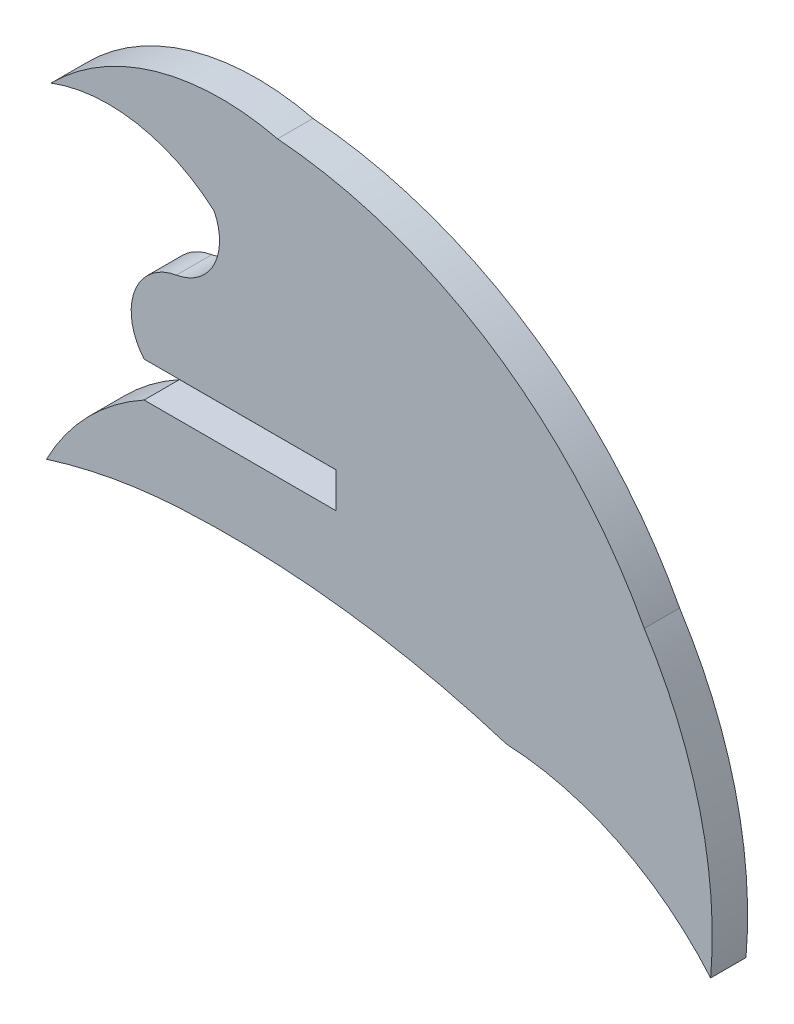
ISO-10303-21;
HEADER;
FILE_DESCRIPTION(('STEP AP214'),'2;1');
FILE_NAME('part.step','',(''),(''),'','','');
FILE_SCHEMA(('AUTOMOTIVE_DESIGN { 1 0 10303 214 1 1 1 1 }'));
ENDSEC;
DATA;
#1=APPLICATION_CONTEXT('core data for automotive mechanical design processes');
#2=APPLICATION_PROTOCOL_DEFINITION('international standard','automotive_design',2000,#1);
#3=PRODUCT_CONTEXT('',#1,'mechanical');
#4=PRODUCT('Part','Part','',(#3));
#5=PRODUCT_RELATED_PRODUCT_CATEGORY('part','',(#4));
#6=PRODUCT_DEFINITION_FORMATION('','',#4);
#7=PRODUCT_DEFINITION_CONTEXT('part definition',#1,'design');
#8=PRODUCT_DEFINITION('design','',#6,#7);
#9=PRODUCT_DEFINITION_SHAPE('','',#8);
#10=(LENGTH_UNIT() NAMED_UNIT(*) SI_UNIT(.MILLI.,.METRE.));
#11=(NAMED_UNIT(*) PLANE_ANGLE_UNIT() SI_UNIT($,.RADIAN.));
#12=(NAMED_UNIT(*) SI_UNIT($,.STERADIAN.) SOLID_ANGLE_UNIT());
#13=UNCERTAINTY_MEASURE_WITH_UNIT(LENGTH_MEASURE(1.E-05),#10,'distance_accuracy_value','');
#14=(GEOMETRIC_REPRESENTATION_CONTEXT(3) GLOBAL_UNCERTAINTY_ASSIGNED_CONTEXT((#13)) GLOBAL_UNIT_ASSIGNED_CONTEXT((#10,
#11,#12)) REPRESENTATION_CONTEXT('',''));
#15=CARTESIAN_POINT('',(0.,0.,0.));
#16=DIRECTION('',(0.,0.,1.));
#17=DIRECTION('',(1.,0.,0.));
#18=AXIS2_PLACEMENT_3D('',#15,#16,#17);
#19=CARTESIAN_POINT('',(4.09875416760535,-21.0416221765068,1.524));
#20=DIRECTION('',(0.,0.,-1.));
#21=DIRECTION('',(-1.,0.,0.));
#22=AXIS2_PLACEMENT_3D('',#19,#20,#21);
#23=CYLINDRICAL_SURFACE('',#22,12.343629066814);
#24=CARTESIAN_POINT('',(4.09875416760535,-21.0416221765068,0.));
#25=DIRECTION('',(0.,0.,-1.));
#26=DIRECTION('',(1.,0.,0.));
#27=AXIS2_PLACEMENT_3D('',#24,#25,#26);
#28=CIRCLE('',#27,12.343629066814);
#29=CARTESIAN_POINT('',(4.69712194571442,-8.71250483011021,0.));
#30=VERTEX_POINT('',#29);
#31=CARTESIAN_POINT('',(13.5003168965857,-13.0431350200413,0.));
#32=VERTEX_POINT('',#31);
#33=EDGE_CURVE('E160',#30,#32,#28,.T.);
#34=ORIENTED_EDGE('',*,*,#33,.T.);
#35=DIRECTION('',(0.,0.,-1.));
#36=VECTOR('',#35,1.);
#37=CARTESIAN_POINT('',(13.5003168965857,-13.0431350200413,1.524));
#38=LINE('',#37,#36);
#39=CARTESIAN_POINT('',(13.5003168965857,-13.0431350200413,1.524));
#40=VERTEX_POINT('',#39);
#41=EDGE_CURVE('E11',#40,#32,#38,.T.);
#42=ORIENTED_EDGE('',*,*,#41,.F.);
#43=CARTESIAN_POINT('',(4.09875416760535,-21.0416221765068,1.524));
#44=DIRECTION('',(0.,0.,-1.));
#45=DIRECTION('',(1.,0.,0.));
#46=AXIS2_PLACEMENT_3D('',#43,#44,#45);
#47=CIRCLE('',#46,12.343629066814);
#48=CARTESIAN_POINT('',(4.69712194571442,-8.71250483011021,1.524));
#49=VERTEX_POINT('',#48);
#50=EDGE_CURVE('E184',#49,#40,#47,.T.);
#51=ORIENTED_EDGE('',*,*,#50,.F.);
#52=DIRECTION('',(0.,0.,-1.));
#53=VECTOR('',#52,1.);
#54=CARTESIAN_POINT('',(4.69712194571442,-8.71250483011021,1.524));
#55=LINE('',#54,#53);
#56=EDGE_CURVE('E156',#49,#30,#55,.T.);
#57=ORIENTED_EDGE('',*,*,#56,.T.);
#58=EDGE_LOOP('',(#34,#42,#51,#57));
#59=FACE_BOUND('',#58,.T.);
#60=ADVANCED_FACE('F34',(#59),#23,.F.);
#61=CARTESIAN_POINT('',(-4.96687949507016,-11.4361547768725,1.524));
#62=DIRECTION('',(0.,0.,-1.));
#63=DIRECTION('',(-1.,0.,0.));
#64=AXIS2_PLACEMENT_3D('',#61,#62,#63);
#65=CYLINDRICAL_SURFACE('',#64,18.5369827121331);
#66=CARTESIAN_POINT('',(-4.96687949507016,-11.4361547768725,0.));
#67=DIRECTION('',(0.,0.,1.));
#68=DIRECTION('',(-1.,0.,0.));
#69=AXIS2_PLACEMENT_3D('',#66,#67,#68);
#70=CIRCLE('',#69,18.5369827121331);
#71=CARTESIAN_POINT('',(10.6404097611869,-1.4345423997881,0.));
#72=VERTEX_POINT('',#71);
#73=EDGE_CURVE('E163',#32,#72,#70,.T.);
#74=ORIENTED_EDGE('',*,*,#73,.T.);
#75=DIRECTION('',(0.,0.,-1.));
#76=VECTOR('',#75,1.);
#77=CARTESIAN_POINT('',(10.6404097611869,-1.4345423997881,1.524));
#78=LINE('',#77,#76);
#79=CARTESIAN_POINT('',(10.6404097611869,-1.4345423997881,1.524));
#80=VERTEX_POINT('',#79);
#81=EDGE_CURVE('E42',#80,#72,#78,.T.);
#82=ORIENTED_EDGE('',*,*,#81,.F.);
#83=CARTESIAN_POINT('',(-4.96687949507016,-11.4361547768725,1.524));
#84=DIRECTION('',(0.,0.,1.));
#85=DIRECTION('',(-1.,0.,0.));
#86=AXIS2_PLACEMENT_3D('',#83,#84,#85);
#87=CIRCLE('',#86,18.5369827121331);
#88=EDGE_CURVE('E108',#40,#80,#87,.T.);
#89=ORIENTED_EDGE('',*,*,#88,.F.);
#90=ORIENTED_EDGE('',*,*,#41,.T.);
#91=EDGE_LOOP('',(#74,#82,#89,#90));
#92=FACE_BOUND('',#91,.T.);
#93=ADVANCED_FACE('F267',(#92),#65,.T.);
#94=CARTESIAN_POINT('',(-6.6798821897993,-10.6072469546407,1.524));
#95=DIRECTION('',(0.,0.,-1.));
#96=DIRECTION('',(-1.,0.,0.));
#97=AXIS2_PLACEMENT_3D('',#94,#95,#96);
#98=CYLINDRICAL_SURFACE('',#97,19.5992607543757);
#99=CARTESIAN_POINT('',(-6.6798821897993,-10.6072469546407,0.));
#100=DIRECTION('',(0.,0.,1.));
#101=DIRECTION('',(1.,0.,0.));
#102=AXIS2_PLACEMENT_3D('',#99,#100,#101);
#103=CIRCLE('',#102,19.5992607543757);
#104=CARTESIAN_POINT('',(-5.15253886855126,8.93241129459815,0.));
#105=VERTEX_POINT('',#104);
#106=EDGE_CURVE('E165',#72,#105,#103,.T.);
#107=ORIENTED_EDGE('',*,*,#106,.T.);
#108=DIRECTION('',(0.,0.,-1.));
#109=VECTOR('',#108,1.);
#110=CARTESIAN_POINT('',(-5.15253886855126,8.93241129459815,1.524));
#111=LINE('',#110,#109);
#112=CARTESIAN_POINT('',(-5.15253886855126,8.93241129459815,1.524));
#113=VERTEX_POINT('',#112);
#114=EDGE_CURVE('E206',#113,#105,#111,.T.);
#115=ORIENTED_EDGE('',*,*,#114,.F.);
#116=CARTESIAN_POINT('',(-6.6798821897993,-10.6072469546407,1.524));
#117=DIRECTION('',(0.,0.,1.));
#118=DIRECTION('',(1.,0.,0.));
#119=AXIS2_PLACEMENT_3D('',#116,#117,#118);
#120=CIRCLE('',#119,19.5992607543757);
#121=EDGE_CURVE('E214',#80,#113,#120,.T.);
#122=ORIENTED_EDGE('',*,*,#121,.F.);
#123=ORIENTED_EDGE('',*,*,#81,.T.);
#124=EDGE_LOOP('',(#107,#115,#122,#123));
#125=FACE_BOUND('',#124,.T.);
#126=ADVANCED_FACE('F212',(#125),#98,.T.);
#127=CARTESIAN_POINT('',(-7.56910722269646,-1.04148036988545,1.524));
#128=DIRECTION('',(0.,0.,-1.));
#129=DIRECTION('',(-1.,0.,0.));
#130=AXIS2_PLACEMENT_3D('',#127,#128,#129);
#131=CYLINDRICAL_SURFACE('',#130,10.2624713176267);
#132=CARTESIAN_POINT('',(-7.56910722269646,-1.04148036988545,0.));
#133=DIRECTION('',(0.,0.,1.));
#134=DIRECTION('',(-1.,0.,0.));
#135=AXIS2_PLACEMENT_3D('',#132,#133,#134);
#136=CIRCLE('',#135,10.2624713176267);
#137=CARTESIAN_POINT('',(-14.9073988184123,6.13262542814665,0.));
#138=VERTEX_POINT('',#137);
#139=EDGE_CURVE('E167',#105,#138,#136,.T.);
#140=ORIENTED_EDGE('',*,*,#139,.T.);
#141=DIRECTION('',(0.,0.,-1.));
#142=VECTOR('',#141,1.);
#143=CARTESIAN_POINT('',(-14.9073988184123,6.13262542814665,1.524));
#144=LINE('',#143,#142);
#145=CARTESIAN_POINT('',(-14.9073988184123,6.13262542814665,1.524));
#146=VERTEX_POINT('',#145);
#147=EDGE_CURVE('E203',#146,#138,#144,.T.);
#148=ORIENTED_EDGE('',*,*,#147,.F.);
#149=CARTESIAN_POINT('',(-7.56910722269646,-1.04148036988545,1.524));
#150=DIRECTION('',(0.,0.,1.));
#151=DIRECTION('',(-1.,0.,0.));
#152=AXIS2_PLACEMENT_3D('',#149,#150,#151);
#153=CIRCLE('',#152,10.2624713176267);
#154=EDGE_CURVE('E232',#113,#146,#153,.T.);
#155=ORIENTED_EDGE('',*,*,#154,.F.);
#156=ORIENTED_EDGE('',*,*,#114,.T.);
#157=EDGE_LOOP('',(#140,#148,#155,#156));
#158=FACE_BOUND('',#157,.T.);
#159=ADVANCED_FACE('F223',(#158),#131,.T.);
#160=CARTESIAN_POINT('',(-12.4390952322919,-0.340023654962952,1.524));
#161=DIRECTION('',(0.,0.,-1.));
#162=DIRECTION('',(-1.,0.,0.));
#163=AXIS2_PLACEMENT_3D('',#160,#161,#162);
#164=CYLINDRICAL_SURFACE('',#163,6.92731612865577);
#165=CARTESIAN_POINT('',(-12.4390952322919,-0.340023654962952,0.));
#166=DIRECTION('',(0.,0.,-1.));
#167=DIRECTION('',(1.,0.,0.));
#168=AXIS2_PLACEMENT_3D('',#165,#166,#167);
#169=CIRCLE('',#168,6.92731612865577);
#170=CARTESIAN_POINT('',(-7.88575431551338,4.88058888016404,0.));
#171=VERTEX_POINT('',#170);
#172=EDGE_CURVE('E169',#138,#171,#169,.T.);
#173=ORIENTED_EDGE('',*,*,#172,.T.);
#174=DIRECTION('',(0.,0.,-1.));
#175=VECTOR('',#174,1.);
#176=CARTESIAN_POINT('',(-7.88575431551338,4.88058888016404,1.524));
#177=LINE('',#176,#175);
#178=CARTESIAN_POINT('',(-7.88575431551338,4.88058888016404,1.524));
#179=VERTEX_POINT('',#178);
#180=EDGE_CURVE('E200',#179,#171,#177,.T.);
#181=ORIENTED_EDGE('',*,*,#180,.F.);
#182=CARTESIAN_POINT('',(-12.4390952322919,-0.340023654962952,1.524));
#183=DIRECTION('',(0.,0.,-1.));
#184=DIRECTION('',(1.,0.,0.));
#185=AXIS2_PLACEMENT_3D('',#182,#183,#184);
#186=CIRCLE('',#185,6.92731612865577);
#187=EDGE_CURVE('E229',#146,#179,#186,.T.);
#188=ORIENTED_EDGE('',*,*,#187,.F.);
#189=ORIENTED_EDGE('',*,*,#147,.T.);
#190=EDGE_LOOP('',(#173,#181,#188,#189));
#191=FACE_BOUND('',#190,.T.);
#192=ADVANCED_FACE('F227',(#191),#164,.F.);
#193=CARTESIAN_POINT('',(-9.89407883051692,3.88075028276914,1.524));
#194=DIRECTION('',(0.,0.,-1.));
#195=DIRECTION('',(-1.,0.,0.));
#196=AXIS2_PLACEMENT_3D('',#193,#194,#195);
#197=CYLINDRICAL_SURFACE('',#196,2.24344480172899);
#198=CARTESIAN_POINT('',(-9.89407883051692,3.88075028276914,0.));
#199=DIRECTION('',(0.,0.,-1.));
#200=DIRECTION('',(1.,0.,0.));
#201=AXIS2_PLACEMENT_3D('',#198,#199,#200);
#202=CIRCLE('',#201,2.24344480172899);
#203=CARTESIAN_POINT('',(-9.5117295029412,1.67012739088839,0.));
#204=VERTEX_POINT('',#203);
#205=EDGE_CURVE('E171',#171,#204,#202,.T.);
#206=ORIENTED_EDGE('',*,*,#205,.T.);
#207=DIRECTION('',(0.,0.,-1.));
#208=VECTOR('',#207,1.);
#209=CARTESIAN_POINT('',(-9.5117295029412,1.67012739088839,1.524));
#210=LINE('',#209,#208);
#211=CARTESIAN_POINT('',(-9.5117295029412,1.67012739088839,1.524));
#212=VERTEX_POINT('',#211);
#213=EDGE_CURVE('E197',#212,#204,#210,.T.);
#214=ORIENTED_EDGE('',*,*,#213,.F.);
#215=CARTESIAN_POINT('',(-9.89407883051692,3.88075028276914,1.524));
#216=DIRECTION('',(0.,0.,-1.));
#217=DIRECTION('',(1.,0.,0.));
#218=AXIS2_PLACEMENT_3D('',#215,#216,#217);
#219=CIRCLE('',#218,2.24344480172899);
#220=EDGE_CURVE('E231',#179,#212,#219,.T.);
#221=ORIENTED_EDGE('',*,*,#220,.F.);
#222=ORIENTED_EDGE('',*,*,#180,.T.);
#223=EDGE_LOOP('',(#206,#214,#221,#222));
#224=FACE_BOUND('',#223,.T.);
#225=ADVANCED_FACE('F280',(#224),#197,.F.);
#226=CARTESIAN_POINT('',(-9.11390761549717,-0.640340860817002,1.524));
#227=DIRECTION('',(0.,0.,-1.));
#228=DIRECTION('',(-1.,0.,0.));
#229=AXIS2_PLACEMENT_3D('',#226,#227,#228);
#230=CYLINDRICAL_SURFACE('',#229,2.3444670601798);
#231=CARTESIAN_POINT('',(-9.11390761549717,-0.640340860817002,0.));
#232=DIRECTION('',(0.,0.,1.));
#233=DIRECTION('',(1.,0.,0.));
#234=AXIS2_PLACEMENT_3D('',#231,#232,#233);
#235=CIRCLE('',#234,2.3444670601798);
#236=CARTESIAN_POINT('',(-10.9016832127956,-2.15704261461452,0.));
#237=VERTEX_POINT('',#236);
#238=EDGE_CURVE('E173',#204,#237,#235,.T.);
#239=ORIENTED_EDGE('',*,*,#238,.T.);
#240=DIRECTION('',(0.,0.,-1.));
#241=VECTOR('',#240,1.);
#242=CARTESIAN_POINT('',(-10.9016832127956,-2.15704261461452,1.524));
#243=LINE('',#242,#241);
#244=CARTESIAN_POINT('',(-10.9016832127956,-2.15704261461452,1.524));
#245=VERTEX_POINT('',#244);
#246=EDGE_CURVE('E194',#245,#237,#243,.T.);
#247=ORIENTED_EDGE('',*,*,#246,.F.);
#248=CARTESIAN_POINT('',(-9.11390761549717,-0.640340860817002,1.524));
#249=DIRECTION('',(0.,0.,1.));
#250=DIRECTION('',(1.,0.,0.));
#251=AXIS2_PLACEMENT_3D('',#248,#249,#250);
#252=CIRCLE('',#251,2.3444670601798);
#253=EDGE_CURVE('E234',#212,#245,#252,.T.);
#254=ORIENTED_EDGE('',*,*,#253,.F.);
#255=ORIENTED_EDGE('',*,*,#213,.T.);
#256=EDGE_LOOP('',(#239,#247,#254,#255));
#257=FACE_BOUND('',#256,.T.);
#258=ADVANCED_FACE('F283',(#257),#230,.T.);
#259=CARTESIAN_POINT('',(-2.63595171279561,-2.15505578709308,1.524));
#260=DIRECTION('',(-0.000240369223709465,0.999999971111318,0.));
#261=DIRECTION('',(-0.999999971111318,-0.000240369223709465,0.));
#262=AXIS2_PLACEMENT_3D('',#259,#260,#261);
#263=PLANE('',#262);
#264=DIRECTION('',(0.999999971111318,0.000240369223709465,0.));
#265=VECTOR('',#264,1.);
#266=CARTESIAN_POINT('',(-2.63595171279561,-2.15505578709308,0.));
#267=LINE('',#266,#265);
#268=CARTESIAN_POINT('',(-2.63595171279561,-2.15505578709308,0.));
#269=VERTEX_POINT('',#268);
#270=EDGE_CURVE('E175',#237,#269,#267,.T.);
#271=ORIENTED_EDGE('',*,*,#270,.T.);
#272=DIRECTION('',(0.,0.,-1.));
#273=VECTOR('',#272,1.);
#274=CARTESIAN_POINT('',(-2.63595171279561,-2.15505578709308,1.524));
#275=LINE('',#274,#273);
#276=CARTESIAN_POINT('',(-2.63595171279561,-2.15505578709308,1.524));
#277=VERTEX_POINT('',#276);
#278=EDGE_CURVE('E191',#277,#269,#275,.T.);
#279=ORIENTED_EDGE('',*,*,#278,.F.);
#280=DIRECTION('',(0.999999971111318,0.000240369223709465,0.));
#281=VECTOR('',#280,1.);
#282=CARTESIAN_POINT('',(-2.63595171279561,-2.15505578709308,1.524));
#283=LINE('',#282,#281);
#284=EDGE_CURVE('E240',#245,#277,#283,.T.);
#285=ORIENTED_EDGE('',*,*,#284,.F.);
#286=ORIENTED_EDGE('',*,*,#246,.T.);
#287=EDGE_LOOP('',(#271,#279,#285,#286));
#288=FACE_BOUND('',#287,.T.);
#289=ADVANCED_FACE('F287',(#288),#263,.F.);
#290=CARTESIAN_POINT('',(-2.63595171279561,-3.68103698709308,1.524));
#291=DIRECTION('',(1.,0.,0.));
#292=DIRECTION('',(0.,0.,-1.));
#293=AXIS2_PLACEMENT_3D('',#290,#291,#292);
#294=PLANE('',#293);
#295=DIRECTION('',(0.,-1.,0.));
#296=VECTOR('',#295,1.);
#297=CARTESIAN_POINT('',(-2.63595171279561,-3.68103698709308,0.));
#298=LINE('',#297,#296);
#299=CARTESIAN_POINT('',(-2.63595171279561,-3.68103698709308,0.));
#300=VERTEX_POINT('',#299);
#301=EDGE_CURVE('E177',#269,#300,#298,.T.);
#302=ORIENTED_EDGE('',*,*,#301,.T.);
#303=DIRECTION('',(0.,0.,-1.));
#304=VECTOR('',#303,1.);
#305=CARTESIAN_POINT('',(-2.63595171279561,-3.68103698709308,1.524));
#306=LINE('',#305,#304);
#307=CARTESIAN_POINT('',(-2.63595171279561,-3.68103698709308,1.524));
#308=VERTEX_POINT('',#307);
#309=EDGE_CURVE('E188',#308,#300,#306,.T.);
#310=ORIENTED_EDGE('',*,*,#309,.F.);
#311=DIRECTION('',(0.,-1.,0.));
#312=VECTOR('',#311,1.);
#313=CARTESIAN_POINT('',(-2.63595171279561,-3.68103698709308,1.524));
#314=LINE('',#313,#312);
#315=EDGE_CURVE('E242',#277,#308,#314,.T.);
#316=ORIENTED_EDGE('',*,*,#315,.F.);
#317=ORIENTED_EDGE('',*,*,#278,.T.);
#318=EDGE_LOOP('',(#302,#310,#316,#317));
#319=FACE_BOUND('',#318,.T.);
#320=ADVANCED_FACE('F248',(#319),#294,.F.);
#321=CARTESIAN_POINT('',(-10.9009344646887,-3.68364081967948,1.524));
#322=DIRECTION('',(0.000315043906968152,-0.999999950373667,0.));
#323=DIRECTION('',(0.999999950373667,0.000315043906968152,0.));
#324=AXIS2_PLACEMENT_3D('',#321,#322,#323);
#325=PLANE('',#324);
#326=DIRECTION('',(-0.999999950373667,-0.000315043906968152,0.));
#327=VECTOR('',#326,1.);
#328=CARTESIAN_POINT('',(-10.9009344646887,-3.68364081967948,0.));
#329=LINE('',#328,#327);
#330=CARTESIAN_POINT('',(-10.9009344646887,-3.68364081967948,0.));
#331=VERTEX_POINT('',#330);
#332=EDGE_CURVE('E179',#300,#331,#329,.T.);
#333=ORIENTED_EDGE('',*,*,#332,.T.);
#334=DIRECTION('',(0.,0.,-1.));
#335=VECTOR('',#334,1.);
#336=CARTESIAN_POINT('',(-10.9009344646887,-3.68364081967948,1.524));
#337=LINE('',#336,#335);
#338=CARTESIAN_POINT('',(-10.9009344646887,-3.68364081967948,1.524));
#339=VERTEX_POINT('',#338);
#340=EDGE_CURVE('E151',#339,#331,#337,.T.);
#341=ORIENTED_EDGE('',*,*,#340,.F.);
#342=DIRECTION('',(-0.999999950373667,-0.000315043906968152,0.));
#343=VECTOR('',#342,1.);
#344=CARTESIAN_POINT('',(-10.9009344646887,-3.68364081967948,1.524));
#345=LINE('',#344,#343);
#346=EDGE_CURVE('E142',#308,#339,#345,.T.);
#347=ORIENTED_EDGE('',*,*,#346,.F.);
#348=ORIENTED_EDGE('',*,*,#309,.T.);
#349=EDGE_LOOP('',(#333,#341,#347,#348));
#350=FACE_BOUND('',#349,.T.);
#351=ADVANCED_FACE('F252',(#350),#325,.F.);
#352=CARTESIAN_POINT('',(-5.91129423504871,-12.7559425641714,1.524));
#353=DIRECTION('',(0.,0.,-1.));
#354=DIRECTION('',(-1.,0.,0.));
#355=AXIS2_PLACEMENT_3D('',#352,#353,#354);
#356=CYLINDRICAL_SURFACE('',#355,10.3538962987058);
#357=CARTESIAN_POINT('',(-5.91129423504871,-12.7559425641714,0.));
#358=DIRECTION('',(0.,0.,1.));
#359=DIRECTION('',(1.,0.,0.));
#360=AXIS2_PLACEMENT_3D('',#357,#358,#359);
#361=CIRCLE('',#360,10.3538962987058);
#362=CARTESIAN_POINT('',(-15.1059721432034,-7.99557842582597,0.));
#363=VERTEX_POINT('',#362);
#364=EDGE_CURVE('E150',#331,#363,#361,.T.);
#365=ORIENTED_EDGE('',*,*,#364,.T.);
#366=DIRECTION('',(0.,0.,-1.));
#367=VECTOR('',#366,1.);
#368=CARTESIAN_POINT('',(-15.1059721432034,-7.99557842582597,1.524));
#369=LINE('',#368,#367);
#370=CARTESIAN_POINT('',(-15.1059721432034,-7.99557842582597,1.524));
#371=VERTEX_POINT('',#370);
#372=EDGE_CURVE('E147',#371,#363,#369,.T.);
#373=ORIENTED_EDGE('',*,*,#372,.F.);
#374=CARTESIAN_POINT('',(-5.91129423504871,-12.7559425641714,1.524));
#375=DIRECTION('',(0.,0.,1.));
#376=DIRECTION('',(1.,0.,0.));
#377=AXIS2_PLACEMENT_3D('',#374,#375,#376);
#378=CIRCLE('',#377,10.3538962987058);
#379=EDGE_CURVE('E136',#339,#371,#378,.T.);
#380=ORIENTED_EDGE('',*,*,#379,.F.);
#381=ORIENTED_EDGE('',*,*,#340,.T.);
#382=EDGE_LOOP('',(#365,#373,#380,#381));
#383=FACE_BOUND('',#382,.T.);
#384=ADVANCED_FACE('F148',(#383),#356,.T.);
#385=CARTESIAN_POINT('',(-8.07502070532041,-30.2960216644183,1.524));
#386=DIRECTION('',(0.,0.,-1.));
#387=DIRECTION('',(-1.,0.,0.));
#388=AXIS2_PLACEMENT_3D('',#385,#386,#387);
#389=CYLINDRICAL_SURFACE('',#388,23.382558601649);
#390=CARTESIAN_POINT('',(-8.07502070532041,-30.2960216644183,0.));
#391=DIRECTION('',(0.,0.,-1.));
#392=DIRECTION('',(-1.,0.,0.));
#393=AXIS2_PLACEMENT_3D('',#390,#391,#392);
#394=CIRCLE('',#393,23.382558601649);
#395=CARTESIAN_POINT('',(-9.29311692756121,-6.94521250599918,0.));
#396=VERTEX_POINT('',#395);
#397=EDGE_CURVE('E94',#363,#396,#394,.T.);
#398=ORIENTED_EDGE('',*,*,#397,.T.);
#399=DIRECTION('',(0.,0.,-1.));
#400=VECTOR('',#399,1.);
#401=CARTESIAN_POINT('',(-9.29311692756121,-6.94521250599918,1.524));
#402=LINE('',#401,#400);
#403=CARTESIAN_POINT('',(-9.29311692756121,-6.94521250599918,1.524));
#404=VERTEX_POINT('',#403);
#405=EDGE_CURVE('E152',#404,#396,#402,.T.);
#406=ORIENTED_EDGE('',*,*,#405,.F.);
#407=CARTESIAN_POINT('',(-8.07502070532041,-30.2960216644183,1.524));
#408=DIRECTION('',(0.,0.,-1.));
#409=DIRECTION('',(-1.,0.,0.));
#410=AXIS2_PLACEMENT_3D('',#407,#408,#409);
#411=CIRCLE('',#410,23.382558601649);
#412=EDGE_CURVE('E140',#371,#404,#411,.T.);
#413=ORIENTED_EDGE('',*,*,#412,.F.);
#414=ORIENTED_EDGE('',*,*,#372,.T.);
#415=EDGE_LOOP('',(#398,#406,#413,#414));
#416=FACE_BOUND('',#415,.T.);
#417=ADVANCED_FACE('F154',(#416),#389,.F.);
#418=CARTESIAN_POINT('',(-7.21609720458614,-46.7615178880511,1.524));
#419=DIRECTION('',(0.,0.,-1.));
#420=DIRECTION('',(-1.,0.,0.));
#421=AXIS2_PLACEMENT_3D('',#418,#419,#420);
#422=CYLINDRICAL_SURFACE('',#421,39.8704425007604);
#423=CARTESIAN_POINT('',(-7.21609720458614,-46.7615178880511,0.));
#424=DIRECTION('',(0.,0.,-1.));
#425=DIRECTION('',(1.,0.,0.));
#426=AXIS2_PLACEMENT_3D('',#423,#424,#425);
#427=CIRCLE('',#426,39.8704425007604);
#428=EDGE_CURVE('E100',#396,#30,#427,.T.);
#429=ORIENTED_EDGE('',*,*,#428,.T.);
#430=ORIENTED_EDGE('',*,*,#56,.F.);
#431=CARTESIAN_POINT('',(-7.21609720458614,-46.7615178880511,1.524));
#432=DIRECTION('',(0.,0.,-1.));
#433=DIRECTION('',(1.,0.,0.));
#434=AXIS2_PLACEMENT_3D('',#431,#432,#433);
#435=CIRCLE('',#434,39.8704425007604);
#436=EDGE_CURVE('E50',#404,#49,#435,.T.);
#437=ORIENTED_EDGE('',*,*,#436,.F.);
#438=ORIENTED_EDGE('',*,*,#405,.T.);
#439=EDGE_LOOP('',(#429,#430,#437,#438));
#440=FACE_BOUND('',#439,.T.);
#441=ADVANCED_FACE('F256',(#440),#422,.F.);
#442=CARTESIAN_POINT('',(4.09875416760535,-21.0416221765068,1.524));
#443=DIRECTION('',(0.,0.,1.));
#444=DIRECTION('',(1.,0.,0.));
#445=AXIS2_PLACEMENT_3D('',#442,#443,#444);
#446=PLANE('',#445);
#447=ORIENTED_EDGE('',*,*,#50,.T.);
#448=ORIENTED_EDGE('',*,*,#88,.T.);
#449=ORIENTED_EDGE('',*,*,#121,.T.);
#450=ORIENTED_EDGE('',*,*,#154,.T.);
#451=ORIENTED_EDGE('',*,*,#187,.T.);
#452=ORIENTED_EDGE('',*,*,#220,.T.);
#453=ORIENTED_EDGE('',*,*,#253,.T.);
#454=ORIENTED_EDGE('',*,*,#284,.T.);
#455=ORIENTED_EDGE('',*,*,#315,.T.);
#456=ORIENTED_EDGE('',*,*,#346,.T.);
#457=ORIENTED_EDGE('',*,*,#379,.T.);
#458=ORIENTED_EDGE('',*,*,#412,.T.);
#459=ORIENTED_EDGE('',*,*,#436,.T.);
#460=EDGE_LOOP('',(#447,#448,#449,#450,#451,#452,#453,#454,#455,#456,#457,#458,#459));
#461=FACE_BOUND('',#460,.T.);
#462=ADVANCED_FACE('F138',(#461),#446,.T.);
#463=CARTESIAN_POINT('',(4.09875416760535,-21.0416221765068,0.));
#464=DIRECTION('',(0.,0.,1.));
#465=DIRECTION('',(1.,0.,0.));
#466=AXIS2_PLACEMENT_3D('',#463,#464,#465);
#467=PLANE('',#466);
#468=ORIENTED_EDGE('',*,*,#33,.F.);
#469=ORIENTED_EDGE('',*,*,#428,.F.);
#470=ORIENTED_EDGE('',*,*,#397,.F.);
#471=ORIENTED_EDGE('',*,*,#364,.F.);
#472=ORIENTED_EDGE('',*,*,#332,.F.);
#473=ORIENTED_EDGE('',*,*,#301,.F.);
#474=ORIENTED_EDGE('',*,*,#270,.F.);
#475=ORIENTED_EDGE('',*,*,#238,.F.);
#476=ORIENTED_EDGE('',*,*,#205,.F.);
#477=ORIENTED_EDGE('',*,*,#172,.F.);
#478=ORIENTED_EDGE('',*,*,#139,.F.);
#479=ORIENTED_EDGE('',*,*,#106,.F.);
#480=ORIENTED_EDGE('',*,*,#73,.F.);
#481=EDGE_LOOP('',(#468,#469,#470,#471,#472,#473,#474,#475,#476,#477,#478,#479,#480));
#482=FACE_BOUND('',#481,.T.);
#483=ADVANCED_FACE('F218',(#482),#467,.F.);
#484=CLOSED_SHELL('',(#60,#93,#126,#159,#192,#225,#258,#289,#320,#351,#384,#417,#441,#462,#483));
#485=MANIFOLD_SOLID_BREP('B2',#484);
#486=ADVANCED_BREP_SHAPE_REPRESENTATION('',(#18,#485),#14);
#487=SHAPE_DEFINITION_REPRESENTATION(#9,#486);
ENDSEC;
END-ISO-10303-21;
